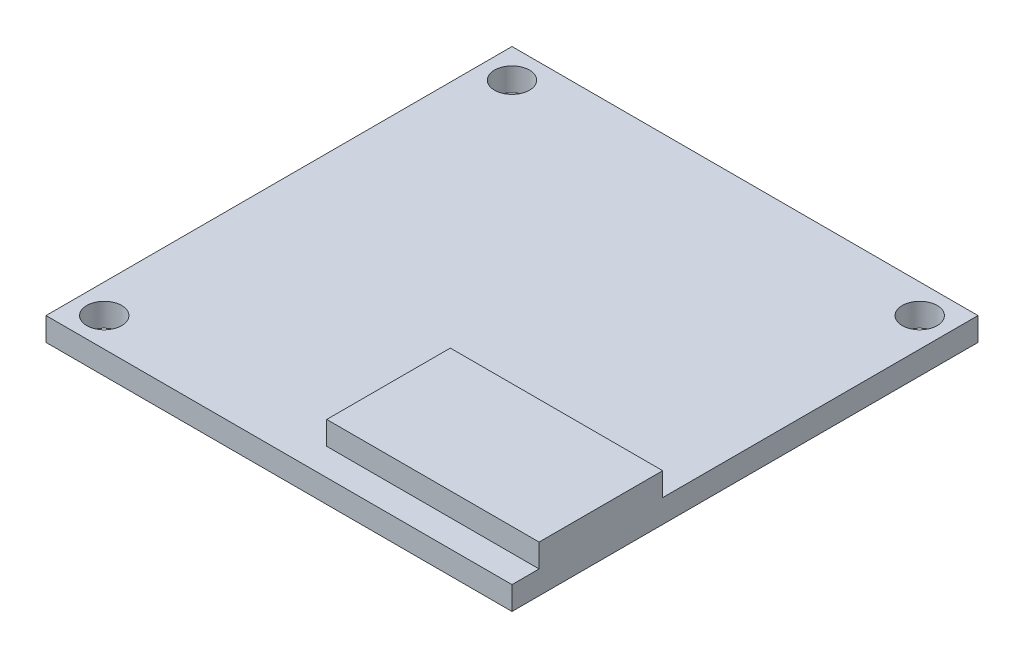
ISO-10303-21;
HEADER;
FILE_DESCRIPTION(('STEP AP214'),'2;1');
FILE_NAME('part.step','',(''),(''),'','','');
FILE_SCHEMA(('AUTOMOTIVE_DESIGN { 1 0 10303 214 1 1 1 1 }'));
ENDSEC;
DATA;
#1=APPLICATION_CONTEXT('core data for automotive mechanical design processes');
#2=APPLICATION_PROTOCOL_DEFINITION('international standard','automotive_design',2000,#1);
#3=PRODUCT_CONTEXT('',#1,'mechanical');
#4=PRODUCT('Part','Part','',(#3));
#5=PRODUCT_RELATED_PRODUCT_CATEGORY('part','',(#4));
#6=PRODUCT_DEFINITION_FORMATION('','',#4);
#7=PRODUCT_DEFINITION_CONTEXT('part definition',#1,'design');
#8=PRODUCT_DEFINITION('design','',#6,#7);
#9=PRODUCT_DEFINITION_SHAPE('','',#8);
#10=(LENGTH_UNIT() NAMED_UNIT(*) SI_UNIT(.MILLI.,.METRE.));
#11=(NAMED_UNIT(*) PLANE_ANGLE_UNIT() SI_UNIT($,.RADIAN.));
#12=(NAMED_UNIT(*) SI_UNIT($,.STERADIAN.) SOLID_ANGLE_UNIT());
#13=UNCERTAINTY_MEASURE_WITH_UNIT(LENGTH_MEASURE(1.E-05),#10,'distance_accuracy_value','');
#14=(GEOMETRIC_REPRESENTATION_CONTEXT(3) GLOBAL_UNCERTAINTY_ASSIGNED_CONTEXT((#13)) GLOBAL_UNIT_ASSIGNED_CONTEXT((#10,
#11,#12)) REPRESENTATION_CONTEXT('',''));
#15=CARTESIAN_POINT('',(0.,0.,0.));
#16=DIRECTION('',(0.,0.,1.));
#17=DIRECTION('',(1.,0.,0.));
#18=AXIS2_PLACEMENT_3D('',#15,#16,#17);
#19=CARTESIAN_POINT('',(0.,2.,0.));
#20=DIRECTION('',(0.,-1.,0.));
#21=DIRECTION('',(0.,0.,-1.));
#22=AXIS2_PLACEMENT_3D('',#19,#20,#21);
#23=PLANE('',#22);
#24=CARTESIAN_POINT('',(2.5,2.,-37.5));
#25=DIRECTION('',(0.,1.,0.));
#26=DIRECTION('',(0.,0.,1.));
#27=AXIS2_PLACEMENT_3D('',#24,#25,#26);
#28=CIRCLE('',#27,1.5);
#29=CARTESIAN_POINT('',(2.5,2.,-36.));
#30=VERTEX_POINT('',#29);
#31=EDGE_CURVE('E130',#30,#30,#28,.T.);
#32=ORIENTED_EDGE('',*,*,#31,.F.);
#33=EDGE_LOOP('',(#32));
#34=FACE_BOUND('',#33,.T.);
#35=CARTESIAN_POINT('',(2.5,2.,-2.5));
#36=DIRECTION('',(0.,1.,0.));
#37=DIRECTION('',(0.,0.,-1.));
#38=AXIS2_PLACEMENT_3D('',#35,#36,#37);
#39=CIRCLE('',#38,1.5);
#40=CARTESIAN_POINT('',(2.5,2.,-4.));
#41=VERTEX_POINT('',#40);
#42=EDGE_CURVE('E118',#41,#41,#39,.T.);
#43=ORIENTED_EDGE('',*,*,#42,.F.);
#44=EDGE_LOOP('',(#43));
#45=FACE_BOUND('',#44,.T.);
#46=CARTESIAN_POINT('',(37.5,2.,-37.5));
#47=DIRECTION('',(0.,1.,0.));
#48=DIRECTION('',(0.,0.,-1.));
#49=AXIS2_PLACEMENT_3D('',#46,#47,#48);
#50=CIRCLE('',#49,1.5);
#51=CARTESIAN_POINT('',(37.5,2.,-39.));
#52=VERTEX_POINT('',#51);
#53=EDGE_CURVE('E131',#52,#52,#50,.T.);
#54=ORIENTED_EDGE('',*,*,#53,.F.);
#55=EDGE_LOOP('',(#54));
#56=FACE_BOUND('',#55,.T.);
#57=DIRECTION('',(-1.,0.,0.));
#58=VECTOR('',#57,1.);
#59=CARTESIAN_POINT('',(21.7701745661065,2.,-12.9355696420272));
#60=LINE('',#59,#58);
#61=CARTESIAN_POINT('',(40.,2.,-12.9355696420272));
#62=VERTEX_POINT('',#61);
#63=CARTESIAN_POINT('',(21.7701745661065,2.,-12.9355696420272));
#64=VERTEX_POINT('',#63);
#65=EDGE_CURVE('E115',#62,#64,#60,.T.);
#66=ORIENTED_EDGE('',*,*,#65,.F.);
#67=DIRECTION('',(0.,0.,-1.));
#68=VECTOR('',#67,1.);
#69=CARTESIAN_POINT('',(40.,2.,0.));
#70=LINE('',#69,#68);
#71=CARTESIAN_POINT('',(40.,2.,-40.));
#72=VERTEX_POINT('',#71);
#73=EDGE_CURVE('E148',#62,#72,#70,.T.);
#74=ORIENTED_EDGE('',*,*,#73,.T.);
#75=DIRECTION('',(-1.,0.,0.));
#76=VECTOR('',#75,1.);
#77=CARTESIAN_POINT('',(0.,2.,-40.));
#78=LINE('',#77,#76);
#79=CARTESIAN_POINT('',(0.,2.,-40.));
#80=VERTEX_POINT('',#79);
#81=EDGE_CURVE('E151',#72,#80,#78,.T.);
#82=ORIENTED_EDGE('',*,*,#81,.T.);
#83=DIRECTION('',(0.,0.,1.));
#84=VECTOR('',#83,1.);
#85=CARTESIAN_POINT('',(0.,2.,0.));
#86=LINE('',#85,#84);
#87=CARTESIAN_POINT('',(0.,2.,0.));
#88=VERTEX_POINT('',#87);
#89=EDGE_CURVE('E142',#80,#88,#86,.T.);
#90=ORIENTED_EDGE('',*,*,#89,.T.);
#91=DIRECTION('',(1.,0.,0.));
#92=VECTOR('',#91,1.);
#93=CARTESIAN_POINT('',(0.,2.,0.));
#94=LINE('',#93,#92);
#95=CARTESIAN_POINT('',(40.,2.,0.));
#96=VERTEX_POINT('',#95);
#97=EDGE_CURVE('E145',#88,#96,#94,.T.);
#98=ORIENTED_EDGE('',*,*,#97,.T.);
#99=CARTESIAN_POINT('',(40.,2.,-2.32523002832462));
#100=VERTEX_POINT('',#99);
#101=EDGE_CURVE('E149',#96,#100,#70,.T.);
#102=ORIENTED_EDGE('',*,*,#101,.T.);
#103=DIRECTION('',(1.,0.,0.));
#104=VECTOR('',#103,1.);
#105=CARTESIAN_POINT('',(21.7701745661065,2.,-2.32523002832462));
#106=LINE('',#105,#104);
#107=CARTESIAN_POINT('',(21.7701745661065,2.,-2.32523002832462));
#108=VERTEX_POINT('',#107);
#109=EDGE_CURVE('E53',#108,#100,#106,.T.);
#110=ORIENTED_EDGE('',*,*,#109,.F.);
#111=DIRECTION('',(0.,0.,1.));
#112=VECTOR('',#111,1.);
#113=CARTESIAN_POINT('',(21.7701745661065,2.,-12.9355696420272));
#114=LINE('',#113,#112);
#115=EDGE_CURVE('E48',#64,#108,#114,.T.);
#116=ORIENTED_EDGE('',*,*,#115,.F.);
#117=EDGE_LOOP('',(#66,#74,#82,#90,#98,#102,#110,#116));
#118=FACE_BOUND('',#117,.T.);
#119=ADVANCED_FACE('F33',(#34,#45,#56,#118),#23,.F.);
#120=CARTESIAN_POINT('',(0.,2.,0.));
#121=DIRECTION('',(1.,0.,0.));
#122=DIRECTION('',(0.,0.,-1.));
#123=AXIS2_PLACEMENT_3D('',#120,#121,#122);
#124=PLANE('',#123);
#125=DIRECTION('',(0.,0.,1.));
#126=VECTOR('',#125,1.);
#127=CARTESIAN_POINT('',(0.,0.,0.));
#128=LINE('',#127,#126);
#129=CARTESIAN_POINT('',(0.,0.,-40.));
#130=VERTEX_POINT('',#129);
#131=CARTESIAN_POINT('',(0.,0.,0.));
#132=VERTEX_POINT('',#131);
#133=EDGE_CURVE('E139',#130,#132,#128,.T.);
#134=ORIENTED_EDGE('',*,*,#133,.T.);
#135=DIRECTION('',(0.,-1.,0.));
#136=VECTOR('',#135,1.);
#137=CARTESIAN_POINT('',(0.,2.,0.));
#138=LINE('',#137,#136);
#139=EDGE_CURVE('E11',#88,#132,#138,.T.);
#140=ORIENTED_EDGE('',*,*,#139,.F.);
#141=ORIENTED_EDGE('',*,*,#89,.F.);
#142=DIRECTION('',(0.,-1.,0.));
#143=VECTOR('',#142,1.);
#144=CARTESIAN_POINT('',(0.,2.,-40.));
#145=LINE('',#144,#143);
#146=EDGE_CURVE('E153',#80,#130,#145,.T.);
#147=ORIENTED_EDGE('',*,*,#146,.T.);
#148=EDGE_LOOP('',(#134,#140,#141,#147));
#149=FACE_BOUND('',#148,.T.);
#150=ADVANCED_FACE('F35',(#149),#124,.F.);
#151=CARTESIAN_POINT('',(0.,2.,0.));
#152=DIRECTION('',(0.,0.,-1.));
#153=DIRECTION('',(-1.,0.,0.));
#154=AXIS2_PLACEMENT_3D('',#151,#152,#153);
#155=PLANE('',#154);
#156=DIRECTION('',(1.,0.,0.));
#157=VECTOR('',#156,1.);
#158=CARTESIAN_POINT('',(0.,0.,0.));
#159=LINE('',#158,#157);
#160=CARTESIAN_POINT('',(40.,0.,0.));
#161=VERTEX_POINT('',#160);
#162=EDGE_CURVE('E156',#132,#161,#159,.T.);
#163=ORIENTED_EDGE('',*,*,#162,.T.);
#164=DIRECTION('',(0.,-1.,0.));
#165=VECTOR('',#164,1.);
#166=CARTESIAN_POINT('',(40.,2.,0.));
#167=LINE('',#166,#165);
#168=EDGE_CURVE('E41',#96,#161,#167,.T.);
#169=ORIENTED_EDGE('',*,*,#168,.F.);
#170=ORIENTED_EDGE('',*,*,#97,.F.);
#171=ORIENTED_EDGE('',*,*,#139,.T.);
#172=EDGE_LOOP('',(#163,#169,#170,#171));
#173=FACE_BOUND('',#172,.T.);
#174=ADVANCED_FACE('F210',(#173),#155,.F.);
#175=CARTESIAN_POINT('',(40.,2.,0.));
#176=DIRECTION('',(-1.,0.,0.));
#177=DIRECTION('',(0.,0.,1.));
#178=AXIS2_PLACEMENT_3D('',#175,#176,#177);
#179=PLANE('',#178);
#180=DIRECTION('',(0.,0.,-1.));
#181=VECTOR('',#180,1.);
#182=CARTESIAN_POINT('',(40.,0.,0.));
#183=LINE('',#182,#181);
#184=CARTESIAN_POINT('',(40.,0.,-40.));
#185=VERTEX_POINT('',#184);
#186=EDGE_CURVE('E158',#161,#185,#183,.T.);
#187=ORIENTED_EDGE('',*,*,#186,.T.);
#188=DIRECTION('',(0.,-1.,0.));
#189=VECTOR('',#188,1.);
#190=CARTESIAN_POINT('',(40.,2.,-40.));
#191=LINE('',#190,#189);
#192=EDGE_CURVE('E163',#72,#185,#191,.T.);
#193=ORIENTED_EDGE('',*,*,#192,.F.);
#194=ORIENTED_EDGE('',*,*,#73,.F.);
#195=DIRECTION('',(0.,-1.,0.));
#196=VECTOR('',#195,1.);
#197=CARTESIAN_POINT('',(40.,4.,-12.9355696420272));
#198=LINE('',#197,#196);
#199=CARTESIAN_POINT('',(40.,4.,-12.9355696420272));
#200=VERTEX_POINT('',#199);
#201=EDGE_CURVE('E123',#200,#62,#198,.T.);
#202=ORIENTED_EDGE('',*,*,#201,.F.);
#203=DIRECTION('',(0.,0.,-1.));
#204=VECTOR('',#203,1.);
#205=CARTESIAN_POINT('',(40.,4.,-12.9355696420272));
#206=LINE('',#205,#204);
#207=CARTESIAN_POINT('',(40.,4.,-2.32523002832462));
#208=VERTEX_POINT('',#207);
#209=EDGE_CURVE('E105',#208,#200,#206,.T.);
#210=ORIENTED_EDGE('',*,*,#209,.F.);
#211=DIRECTION('',(0.,-1.,0.));
#212=VECTOR('',#211,1.);
#213=CARTESIAN_POINT('',(40.,4.,-2.32523002832462));
#214=LINE('',#213,#212);
#215=EDGE_CURVE('E102',#208,#100,#214,.T.);
#216=ORIENTED_EDGE('',*,*,#215,.T.);
#217=ORIENTED_EDGE('',*,*,#101,.F.);
#218=ORIENTED_EDGE('',*,*,#168,.T.);
#219=EDGE_LOOP('',(#187,#193,#194,#202,#210,#216,#217,#218));
#220=FACE_BOUND('',#219,.T.);
#221=ADVANCED_FACE('F170',(#220),#179,.F.);
#222=CARTESIAN_POINT('',(0.,2.,-40.));
#223=DIRECTION('',(0.,0.,1.));
#224=DIRECTION('',(1.,0.,0.));
#225=AXIS2_PLACEMENT_3D('',#222,#223,#224);
#226=PLANE('',#225);
#227=DIRECTION('',(-1.,0.,0.));
#228=VECTOR('',#227,1.);
#229=CARTESIAN_POINT('',(0.,0.,-40.));
#230=LINE('',#229,#228);
#231=EDGE_CURVE('E146',#185,#130,#230,.T.);
#232=ORIENTED_EDGE('',*,*,#231,.T.);
#233=ORIENTED_EDGE('',*,*,#146,.F.);
#234=ORIENTED_EDGE('',*,*,#81,.F.);
#235=ORIENTED_EDGE('',*,*,#192,.T.);
#236=EDGE_LOOP('',(#232,#233,#234,#235));
#237=FACE_BOUND('',#236,.T.);
#238=ADVANCED_FACE('F179',(#237),#226,.F.);
#239=CARTESIAN_POINT('',(0.,0.,0.));
#240=DIRECTION('',(0.,-1.,0.));
#241=DIRECTION('',(0.,0.,-1.));
#242=AXIS2_PLACEMENT_3D('',#239,#240,#241);
#243=PLANE('',#242);
#244=CARTESIAN_POINT('',(37.5,0.,-37.5));
#245=DIRECTION('',(0.,1.,0.));
#246=DIRECTION('',(0.,0.,-1.));
#247=AXIS2_PLACEMENT_3D('',#244,#245,#246);
#248=CIRCLE('',#247,1.5);
#249=CARTESIAN_POINT('',(37.5,0.,-39.));
#250=VERTEX_POINT('',#249);
#251=EDGE_CURVE('E127',#250,#250,#248,.T.);
#252=ORIENTED_EDGE('',*,*,#251,.T.);
#253=EDGE_LOOP('',(#252));
#254=FACE_BOUND('',#253,.T.);
#255=CARTESIAN_POINT('',(2.5,0.,-2.5));
#256=DIRECTION('',(0.,1.,0.));
#257=DIRECTION('',(0.,0.,-1.));
#258=AXIS2_PLACEMENT_3D('',#255,#256,#257);
#259=CIRCLE('',#258,1.5);
#260=CARTESIAN_POINT('',(2.5,0.,-4.));
#261=VERTEX_POINT('',#260);
#262=EDGE_CURVE('E121',#261,#261,#259,.T.);
#263=ORIENTED_EDGE('',*,*,#262,.T.);
#264=EDGE_LOOP('',(#263));
#265=FACE_BOUND('',#264,.T.);
#266=CARTESIAN_POINT('',(2.5,0.,-37.5));
#267=DIRECTION('',(0.,1.,0.));
#268=DIRECTION('',(0.,0.,1.));
#269=AXIS2_PLACEMENT_3D('',#266,#267,#268);
#270=CIRCLE('',#269,1.5);
#271=CARTESIAN_POINT('',(2.5,0.,-36.));
#272=VERTEX_POINT('',#271);
#273=EDGE_CURVE('E136',#272,#272,#270,.T.);
#274=ORIENTED_EDGE('',*,*,#273,.T.);
#275=EDGE_LOOP('',(#274));
#276=FACE_BOUND('',#275,.T.);
#277=ORIENTED_EDGE('',*,*,#133,.F.);
#278=ORIENTED_EDGE('',*,*,#231,.F.);
#279=ORIENTED_EDGE('',*,*,#186,.F.);
#280=ORIENTED_EDGE('',*,*,#162,.F.);
#281=EDGE_LOOP('',(#277,#278,#279,#280));
#282=FACE_BOUND('',#281,.T.);
#283=ADVANCED_FACE('F176',(#254,#265,#276,#282),#243,.T.);
#284=CARTESIAN_POINT('',(2.5,0.,-37.5));
#285=DIRECTION('',(0.,1.,0.));
#286=DIRECTION('',(0.,0.,1.));
#287=AXIS2_PLACEMENT_3D('',#284,#285,#286);
#288=CYLINDRICAL_SURFACE('',#287,1.5);
#289=ORIENTED_EDGE('',*,*,#273,.F.);
#290=EDGE_LOOP('',(#289));
#291=FACE_BOUND('',#290,.T.);
#292=ORIENTED_EDGE('',*,*,#31,.T.);
#293=EDGE_LOOP('',(#292));
#294=FACE_BOUND('',#293,.T.);
#295=ADVANCED_FACE('F215',(#291,#294),#288,.F.);
#296=CARTESIAN_POINT('',(2.5,0.,-2.5));
#297=DIRECTION('',(0.,1.,0.));
#298=DIRECTION('',(0.,0.,1.));
#299=AXIS2_PLACEMENT_3D('',#296,#297,#298);
#300=CYLINDRICAL_SURFACE('',#299,1.5);
#301=ORIENTED_EDGE('',*,*,#262,.F.);
#302=EDGE_LOOP('',(#301));
#303=FACE_BOUND('',#302,.T.);
#304=ORIENTED_EDGE('',*,*,#42,.T.);
#305=EDGE_LOOP('',(#304));
#306=FACE_BOUND('',#305,.T.);
#307=ADVANCED_FACE('F247',(#303,#306),#300,.F.);
#308=CARTESIAN_POINT('',(37.5,0.,-37.5));
#309=DIRECTION('',(0.,1.,0.));
#310=DIRECTION('',(0.,0.,1.));
#311=AXIS2_PLACEMENT_3D('',#308,#309,#310);
#312=CYLINDRICAL_SURFACE('',#311,1.5);
#313=ORIENTED_EDGE('',*,*,#251,.F.);
#314=EDGE_LOOP('',(#313));
#315=FACE_BOUND('',#314,.T.);
#316=ORIENTED_EDGE('',*,*,#53,.T.);
#317=EDGE_LOOP('',(#316));
#318=FACE_BOUND('',#317,.T.);
#319=ADVANCED_FACE('F254',(#315,#318),#312,.F.);
#320=CARTESIAN_POINT('',(21.7701745661065,4.,-12.9355696420272));
#321=DIRECTION('',(1.,0.,0.));
#322=DIRECTION('',(0.,0.,-1.));
#323=AXIS2_PLACEMENT_3D('',#320,#321,#322);
#324=PLANE('',#323);
#325=ORIENTED_EDGE('',*,*,#115,.T.);
#326=DIRECTION('',(0.,-1.,0.));
#327=VECTOR('',#326,1.);
#328=CARTESIAN_POINT('',(21.7701745661065,4.,-2.32523002832462));
#329=LINE('',#328,#327);
#330=CARTESIAN_POINT('',(21.7701745661065,4.,-2.32523002832462));
#331=VERTEX_POINT('',#330);
#332=EDGE_CURVE('E100',#331,#108,#329,.T.);
#333=ORIENTED_EDGE('',*,*,#332,.F.);
#334=DIRECTION('',(0.,0.,1.));
#335=VECTOR('',#334,1.);
#336=CARTESIAN_POINT('',(21.7701745661065,4.,-12.9355696420272));
#337=LINE('',#336,#335);
#338=CARTESIAN_POINT('',(21.7701745661065,4.,-12.9355696420272));
#339=VERTEX_POINT('',#338);
#340=EDGE_CURVE('E106',#339,#331,#337,.T.);
#341=ORIENTED_EDGE('',*,*,#340,.F.);
#342=DIRECTION('',(0.,-1.,0.));
#343=VECTOR('',#342,1.);
#344=CARTESIAN_POINT('',(21.7701745661065,4.,-12.9355696420272));
#345=LINE('',#344,#343);
#346=EDGE_CURVE('E189',#339,#64,#345,.T.);
#347=ORIENTED_EDGE('',*,*,#346,.T.);
#348=EDGE_LOOP('',(#325,#333,#341,#347));
#349=FACE_BOUND('',#348,.T.);
#350=ADVANCED_FACE('F117',(#349),#324,.F.);
#351=CARTESIAN_POINT('',(21.7701745661065,4.,-2.32523002832462));
#352=DIRECTION('',(0.,0.,-1.));
#353=DIRECTION('',(-1.,0.,0.));
#354=AXIS2_PLACEMENT_3D('',#351,#352,#353);
#355=PLANE('',#354);
#356=ORIENTED_EDGE('',*,*,#109,.T.);
#357=ORIENTED_EDGE('',*,*,#215,.F.);
#358=DIRECTION('',(1.,0.,0.));
#359=VECTOR('',#358,1.);
#360=CARTESIAN_POINT('',(21.7701745661065,4.,-2.32523002832462));
#361=LINE('',#360,#359);
#362=EDGE_CURVE('E96',#331,#208,#361,.T.);
#363=ORIENTED_EDGE('',*,*,#362,.F.);
#364=ORIENTED_EDGE('',*,*,#332,.T.);
#365=EDGE_LOOP('',(#356,#357,#363,#364));
#366=FACE_BOUND('',#365,.T.);
#367=ADVANCED_FACE('F98',(#366),#355,.F.);
#368=CARTESIAN_POINT('',(21.7701745661065,4.,-12.9355696420272));
#369=DIRECTION('',(0.,0.,1.));
#370=DIRECTION('',(1.,0.,0.));
#371=AXIS2_PLACEMENT_3D('',#368,#369,#370);
#372=PLANE('',#371);
#373=ORIENTED_EDGE('',*,*,#65,.T.);
#374=ORIENTED_EDGE('',*,*,#346,.F.);
#375=DIRECTION('',(-1.,0.,0.));
#376=VECTOR('',#375,1.);
#377=CARTESIAN_POINT('',(21.7701745661065,4.,-12.9355696420272));
#378=LINE('',#377,#376);
#379=EDGE_CURVE('E111',#200,#339,#378,.T.);
#380=ORIENTED_EDGE('',*,*,#379,.F.);
#381=ORIENTED_EDGE('',*,*,#201,.T.);
#382=EDGE_LOOP('',(#373,#374,#380,#381));
#383=FACE_BOUND('',#382,.T.);
#384=ADVANCED_FACE('F188',(#383),#372,.F.);
#385=CARTESIAN_POINT('',(0.,4.,0.));
#386=DIRECTION('',(0.,1.,0.));
#387=DIRECTION('',(0.,0.,1.));
#388=AXIS2_PLACEMENT_3D('',#385,#386,#387);
#389=PLANE('',#388);
#390=ORIENTED_EDGE('',*,*,#340,.T.);
#391=ORIENTED_EDGE('',*,*,#362,.T.);
#392=ORIENTED_EDGE('',*,*,#209,.T.);
#393=ORIENTED_EDGE('',*,*,#379,.T.);
#394=EDGE_LOOP('',(#390,#391,#392,#393));
#395=FACE_BOUND('',#394,.T.);
#396=ADVANCED_FACE('F109',(#395),#389,.T.);
#397=CLOSED_SHELL('',(#119,#150,#174,#221,#238,#283,#295,#307,#319,#350,#367,#384,#396));
#398=MANIFOLD_SOLID_BREP('B2',#397);
#399=ADVANCED_BREP_SHAPE_REPRESENTATION('',(#18,#398),#14);
#400=SHAPE_DEFINITION_REPRESENTATION(#9,#399);
ENDSEC;
END-ISO-10303-21;
